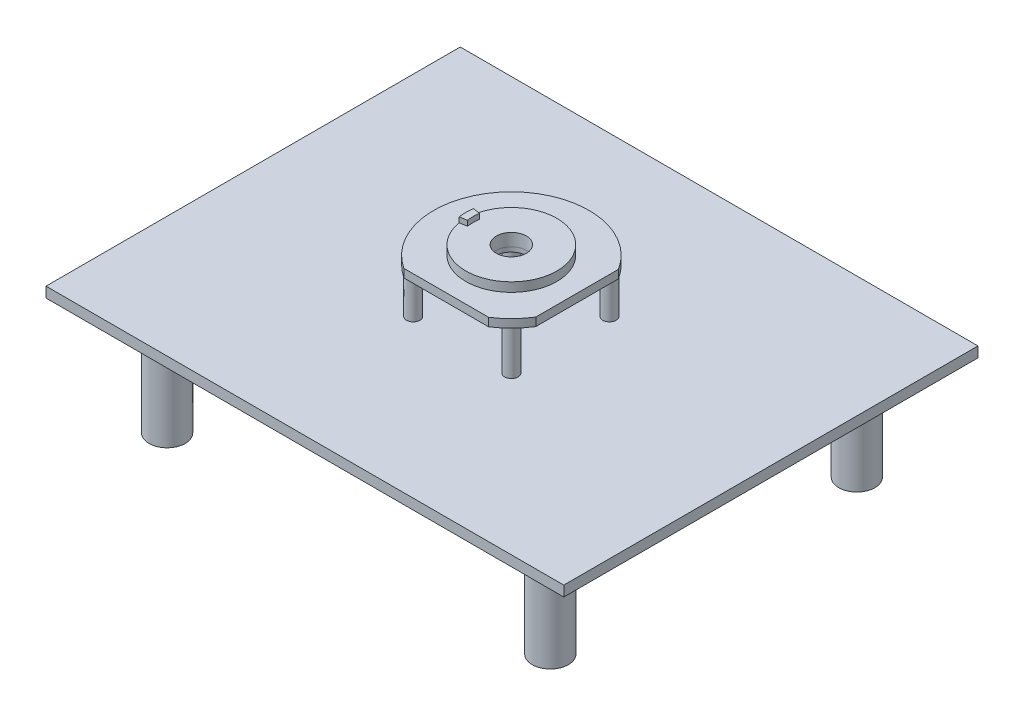
ISO-10303-21;
HEADER;
FILE_DESCRIPTION(('STEP AP214'),'2;1');
FILE_NAME('part.step','',(''),(''),'','','');
FILE_SCHEMA(('AUTOMOTIVE_DESIGN { 1 0 10303 214 1 1 1 1 }'));
ENDSEC;
DATA;
#1=APPLICATION_CONTEXT('core data for automotive mechanical design processes');
#2=APPLICATION_PROTOCOL_DEFINITION('international standard','automotive_design',2000,#1);
#3=PRODUCT_CONTEXT('',#1,'mechanical');
#4=PRODUCT('Part','Part','',(#3));
#5=PRODUCT_RELATED_PRODUCT_CATEGORY('part','',(#4));
#6=PRODUCT_DEFINITION_FORMATION('','',#4);
#7=PRODUCT_DEFINITION_CONTEXT('part definition',#1,'design');
#8=PRODUCT_DEFINITION('design','',#6,#7);
#9=PRODUCT_DEFINITION_SHAPE('','',#8);
#10=(LENGTH_UNIT() NAMED_UNIT(*) SI_UNIT(.MILLI.,.METRE.));
#11=(NAMED_UNIT(*) PLANE_ANGLE_UNIT() SI_UNIT($,.RADIAN.));
#12=(NAMED_UNIT(*) SI_UNIT($,.STERADIAN.) SOLID_ANGLE_UNIT());
#13=UNCERTAINTY_MEASURE_WITH_UNIT(LENGTH_MEASURE(1.E-05),#10,'distance_accuracy_value','');
#14=(GEOMETRIC_REPRESENTATION_CONTEXT(3) GLOBAL_UNCERTAINTY_ASSIGNED_CONTEXT((#13)) GLOBAL_UNIT_ASSIGNED_CONTEXT((#10,
#11,#12)) REPRESENTATION_CONTEXT('',''));
#15=CARTESIAN_POINT('',(0.,0.,0.));
#16=DIRECTION('',(0.,0.,1.));
#17=DIRECTION('',(1.,0.,0.));
#18=AXIS2_PLACEMENT_3D('',#15,#16,#17);
#19=CARTESIAN_POINT('',(0.,50.,0.623845660501408));
#20=DIRECTION('',(0.,1.,0.));
#21=DIRECTION('',(-1.,0.,0.));
#22=AXIS2_PLACEMENT_3D('',#19,#20,#21);
#23=CYLINDRICAL_SURFACE('',#22,75.);
#24=CARTESIAN_POINT('',(0.,53.175,0.623845660501408));
#25=DIRECTION('',(0.,-1.,0.));
#26=DIRECTION('',(1.,0.,0.));
#27=AXIS2_PLACEMENT_3D('',#24,#25,#26);
#28=CIRCLE('',#27,75.);
#29=CARTESIAN_POINT('',(63.5,53.175,40.5331177661161));
#30=VERTEX_POINT('',#29);
#31=CARTESIAN_POINT('',(40.8850732599998,53.175,63.5));
#32=VERTEX_POINT('',#31);
#33=EDGE_CURVE('E239',#30,#32,#28,.T.);
#34=ORIENTED_EDGE('',*,*,#33,.F.);
#35=DIRECTION('',(0.,1.,0.));
#36=VECTOR('',#35,1.);
#37=CARTESIAN_POINT('',(63.5,50.,40.5331177661161));
#38=LINE('',#37,#36);
#39=CARTESIAN_POINT('',(63.5,61.175,40.5331177661161));
#40=VERTEX_POINT('',#39);
#41=EDGE_CURVE('E62',#30,#40,#38,.T.);
#42=ORIENTED_EDGE('',*,*,#41,.T.);
#43=CARTESIAN_POINT('',(0.,61.175,0.623845660501408));
#44=DIRECTION('',(0.,-1.,0.));
#45=DIRECTION('',(1.,0.,0.));
#46=AXIS2_PLACEMENT_3D('',#43,#44,#45);
#47=CIRCLE('',#46,75.);
#48=CARTESIAN_POINT('',(40.8850732599998,61.175,63.5));
#49=VERTEX_POINT('',#48);
#50=EDGE_CURVE('E238',#40,#49,#47,.T.);
#51=ORIENTED_EDGE('',*,*,#50,.T.);
#52=DIRECTION('',(0.,1.,0.));
#53=VECTOR('',#52,1.);
#54=CARTESIAN_POINT('',(40.8850732599998,50.,63.5));
#55=LINE('',#54,#53);
#56=EDGE_CURVE('E266',#49,#32,#55,.F.);
#57=ORIENTED_EDGE('',*,*,#56,.T.);
#58=EDGE_LOOP('',(#34,#42,#51,#57));
#59=FACE_BOUND('',#58,.T.);
#60=ADVANCED_FACE('F44',(#59),#23,.T.);
#61=CARTESIAN_POINT('',(14.5,58.,0.623845660501408));
#62=DIRECTION('',(0.,-1.,0.));
#63=DIRECTION('',(0.,0.,-1.));
#64=AXIS2_PLACEMENT_3D('',#61,#62,#63);
#65=PLANE('',#64);
#66=CARTESIAN_POINT('',(0.,58.,0.623845660501408));
#67=DIRECTION('',(0.,-1.,0.));
#68=DIRECTION('',(0.,0.,-1.));
#69=AXIS2_PLACEMENT_3D('',#66,#67,#68);
#70=CIRCLE('',#69,14.5);
#71=CARTESIAN_POINT('',(0.,58.,-13.8761543394986));
#72=VERTEX_POINT('',#71);
#73=EDGE_CURVE('E274',#72,#72,#70,.T.);
#74=ORIENTED_EDGE('',*,*,#73,.F.);
#75=EDGE_LOOP('',(#74));
#76=FACE_BOUND('',#75,.T.);
#77=CARTESIAN_POINT('',(0.,58.,0.623845660501408));
#78=DIRECTION('',(0.,1.,0.));
#79=DIRECTION('',(-1.,0.,0.));
#80=AXIS2_PLACEMENT_3D('',#77,#78,#79);
#81=CIRCLE('',#80,15.);
#82=CARTESIAN_POINT('',(-15.,58.,0.623845660501408));
#83=VERTEX_POINT('',#82);
#84=EDGE_CURVE('E242',#83,#83,#81,.T.);
#85=ORIENTED_EDGE('',*,*,#84,.F.);
#86=EDGE_LOOP('',(#85));
#87=FACE_BOUND('',#86,.T.);
#88=ADVANCED_FACE('F302',(#76,#87),#65,.T.);
#89=CARTESIAN_POINT('',(0.,58.,0.623845660501408));
#90=DIRECTION('',(0.,-1.,0.));
#91=DIRECTION('',(0.,0.,-1.));
#92=AXIS2_PLACEMENT_3D('',#89,#90,#91);
#93=CYLINDRICAL_SURFACE('',#92,44.);
#94=CARTESIAN_POINT('',(0.,70.,0.623845660501408));
#95=DIRECTION('',(0.,-1.,0.));
#96=DIRECTION('',(0.,0.,-1.));
#97=AXIS2_PLACEMENT_3D('',#94,#95,#96);
#98=CIRCLE('',#97,44.);
#99=CARTESIAN_POINT('',(-43.458286986186,70.,-6.25927080126876));
#100=VERTEX_POINT('',#99);
#101=CARTESIAN_POINT('',(-43.458286986186,70.,7.50696212227159));
#102=VERTEX_POINT('',#101);
#103=EDGE_CURVE('E218',#100,#102,#98,.T.);
#104=ORIENTED_EDGE('',*,*,#103,.T.);
#105=DIRECTION('',(0.,-1.,0.));
#106=VECTOR('',#105,1.);
#107=CARTESIAN_POINT('',(-43.458286986186,75.,7.50696212227159));
#108=LINE('',#107,#106);
#109=CARTESIAN_POINT('',(-43.458286986186,75.,7.50696212227159));
#110=VERTEX_POINT('',#109);
#111=EDGE_CURVE('E220',#110,#102,#108,.T.);
#112=ORIENTED_EDGE('',*,*,#111,.F.);
#113=CARTESIAN_POINT('',(0.,75.,0.623845660501408));
#114=DIRECTION('',(0.,1.,0.));
#115=DIRECTION('',(0.,0.,1.));
#116=AXIS2_PLACEMENT_3D('',#113,#114,#115);
#117=CIRCLE('',#116,44.);
#118=CARTESIAN_POINT('',(-43.458286986186,75.,-6.25927080126876));
#119=VERTEX_POINT('',#118);
#120=EDGE_CURVE('E198',#119,#110,#117,.T.);
#121=ORIENTED_EDGE('',*,*,#120,.F.);
#122=DIRECTION('',(0.,-1.,0.));
#123=VECTOR('',#122,1.);
#124=CARTESIAN_POINT('',(-43.458286986186,75.,-6.25927080126876));
#125=LINE('',#124,#123);
#126=EDGE_CURVE('E209',#119,#100,#125,.T.);
#127=ORIENTED_EDGE('',*,*,#126,.T.);
#128=EDGE_LOOP('',(#104,#112,#121,#127));
#129=FACE_BOUND('',#128,.T.);
#130=CARTESIAN_POINT('',(0.,61.175,0.623845660501408));
#131=DIRECTION('',(0.,-1.,0.));
#132=DIRECTION('',(0.,0.,-1.));
#133=AXIS2_PLACEMENT_3D('',#130,#131,#132);
#134=CIRCLE('',#133,44.);
#135=CARTESIAN_POINT('',(0.,61.175,-43.3761543394986));
#136=VERTEX_POINT('',#135);
#137=EDGE_CURVE('E271',#136,#136,#134,.T.);
#138=ORIENTED_EDGE('',*,*,#137,.F.);
#139=EDGE_LOOP('',(#138));
#140=FACE_BOUND('',#139,.T.);
#141=ADVANCED_FACE('F311',(#129,#140),#93,.T.);
#142=CARTESIAN_POINT('',(0.,58.,0.623845660501408));
#143=DIRECTION('',(0.,-1.,0.));
#144=DIRECTION('',(0.,0.,-1.));
#145=AXIS2_PLACEMENT_3D('',#142,#143,#144);
#146=CYLINDRICAL_SURFACE('',#145,14.5);
#147=ORIENTED_EDGE('',*,*,#73,.T.);
#148=EDGE_LOOP('',(#147));
#149=FACE_BOUND('',#148,.T.);
#150=CARTESIAN_POINT('',(0.,70.,0.623845660501408));
#151=DIRECTION('',(0.,-1.,0.));
#152=DIRECTION('',(0.,0.,-1.));
#153=AXIS2_PLACEMENT_3D('',#150,#151,#152);
#154=CIRCLE('',#153,14.5);
#155=CARTESIAN_POINT('',(0.,70.,-13.8761543394986));
#156=VERTEX_POINT('',#155);
#157=EDGE_CURVE('E616',#156,#156,#154,.T.);
#158=ORIENTED_EDGE('',*,*,#157,.F.);
#159=EDGE_LOOP('',(#158));
#160=FACE_BOUND('',#159,.T.);
#161=ADVANCED_FACE('F422',(#149,#160),#146,.F.);
#162=CARTESIAN_POINT('',(14.5,70.,0.623845660501408));
#163=DIRECTION('',(0.,1.,0.));
#164=DIRECTION('',(0.,0.,1.));
#165=AXIS2_PLACEMENT_3D('',#162,#163,#164);
#166=PLANE('',#165);
#167=DIRECTION('',(-0.987688340595138,0.,-0.156434465040231));
#168=VECTOR('',#167,1.);
#169=CARTESIAN_POINT('',(0.,70.,0.623845660501408));
#170=LINE('',#169,#168);
#171=CARTESIAN_POINT('',(-36.5444686020201,70.,-5.16422954598714));
#172=VERTEX_POINT('',#171);
#173=EDGE_CURVE('E201',#172,#100,#170,.T.);
#174=ORIENTED_EDGE('',*,*,#173,.F.);
#175=CARTESIAN_POINT('',(0.,70.,0.623845660501408));
#176=DIRECTION('',(0.,1.,0.));
#177=DIRECTION('',(0.,0.,1.));
#178=AXIS2_PLACEMENT_3D('',#175,#176,#177);
#179=CIRCLE('',#178,37.);
#180=CARTESIAN_POINT('',(-36.5444686020201,70.,6.41192086698997));
#181=VERTEX_POINT('',#180);
#182=EDGE_CURVE('E212',#172,#181,#179,.T.);
#183=ORIENTED_EDGE('',*,*,#182,.T.);
#184=DIRECTION('',(-0.987688340595138,0.,0.156434465040232));
#185=VECTOR('',#184,1.);
#186=CARTESIAN_POINT('',(0.,70.,0.623845660501408));
#187=LINE('',#186,#185);
#188=EDGE_CURVE('E197',#181,#102,#187,.T.);
#189=ORIENTED_EDGE('',*,*,#188,.T.);
#190=ORIENTED_EDGE('',*,*,#103,.F.);
#191=EDGE_LOOP('',(#174,#183,#189,#190));
#192=FACE_BOUND('',#191,.T.);
#193=ORIENTED_EDGE('',*,*,#157,.T.);
#194=EDGE_LOOP('',(#193));
#195=FACE_BOUND('',#194,.T.);
#196=ADVANCED_FACE('F418',(#192,#195),#166,.T.);
#197=CARTESIAN_POINT('',(0.,75.,0.623845660501408));
#198=DIRECTION('',(0.156434465040232,0.,0.987688340595138));
#199=DIRECTION('',(0.987688340595138,0.,-0.156434465040232));
#200=AXIS2_PLACEMENT_3D('',#197,#198,#199);
#201=PLANE('',#200);
#202=ORIENTED_EDGE('',*,*,#188,.F.);
#203=DIRECTION('',(0.,-1.,0.));
#204=VECTOR('',#203,1.);
#205=CARTESIAN_POINT('',(-36.5444686020201,75.,6.41192086698997));
#206=LINE('',#205,#204);
#207=CARTESIAN_POINT('',(-36.5444686020201,75.,6.41192086698997));
#208=VERTEX_POINT('',#207);
#209=EDGE_CURVE('E222',#208,#181,#206,.T.);
#210=ORIENTED_EDGE('',*,*,#209,.F.);
#211=DIRECTION('',(-0.987688340595138,0.,0.156434465040232));
#212=VECTOR('',#211,1.);
#213=CARTESIAN_POINT('',(0.,75.,0.623845660501408));
#214=LINE('',#213,#212);
#215=EDGE_CURVE('E200',#208,#110,#214,.T.);
#216=ORIENTED_EDGE('',*,*,#215,.T.);
#217=ORIENTED_EDGE('',*,*,#111,.T.);
#218=EDGE_LOOP('',(#202,#210,#216,#217));
#219=FACE_BOUND('',#218,.T.);
#220=ADVANCED_FACE('F414',(#219),#201,.T.);
#221=CARTESIAN_POINT('',(0.,75.,0.623845660501408));
#222=DIRECTION('',(0.,-1.,0.));
#223=DIRECTION('',(0.,0.,-1.));
#224=AXIS2_PLACEMENT_3D('',#221,#222,#223);
#225=CYLINDRICAL_SURFACE('',#224,37.);
#226=ORIENTED_EDGE('',*,*,#182,.F.);
#227=DIRECTION('',(0.,-1.,0.));
#228=VECTOR('',#227,1.);
#229=CARTESIAN_POINT('',(-36.5444686020201,75.,-5.16422954598714));
#230=LINE('',#229,#228);
#231=CARTESIAN_POINT('',(-36.5444686020201,75.,-5.16422954598714));
#232=VERTEX_POINT('',#231);
#233=EDGE_CURVE('E230',#232,#172,#230,.T.);
#234=ORIENTED_EDGE('',*,*,#233,.F.);
#235=CARTESIAN_POINT('',(0.,75.,0.623845660501408));
#236=DIRECTION('',(0.,1.,0.));
#237=DIRECTION('',(0.,0.,1.));
#238=AXIS2_PLACEMENT_3D('',#235,#236,#237);
#239=CIRCLE('',#238,37.);
#240=EDGE_CURVE('E204',#232,#208,#239,.T.);
#241=ORIENTED_EDGE('',*,*,#240,.T.);
#242=ORIENTED_EDGE('',*,*,#209,.T.);
#243=EDGE_LOOP('',(#226,#234,#241,#242));
#244=FACE_BOUND('',#243,.T.);
#245=ADVANCED_FACE('F410',(#244),#225,.F.);
#246=CARTESIAN_POINT('',(0.,75.,0.623845660501408));
#247=DIRECTION('',(-0.156434465040231,0.,0.987688340595138));
#248=DIRECTION('',(0.987688340595138,0.,0.156434465040231));
#249=AXIS2_PLACEMENT_3D('',#246,#247,#248);
#250=PLANE('',#249);
#251=ORIENTED_EDGE('',*,*,#173,.T.);
#252=ORIENTED_EDGE('',*,*,#126,.F.);
#253=DIRECTION('',(-0.987688340595138,0.,-0.156434465040231));
#254=VECTOR('',#253,1.);
#255=CARTESIAN_POINT('',(0.,75.,0.623845660501408));
#256=LINE('',#255,#254);
#257=EDGE_CURVE('E207',#232,#119,#256,.T.);
#258=ORIENTED_EDGE('',*,*,#257,.F.);
#259=ORIENTED_EDGE('',*,*,#233,.T.);
#260=EDGE_LOOP('',(#251,#252,#258,#259));
#261=FACE_BOUND('',#260,.T.);
#262=ADVANCED_FACE('F406',(#261),#250,.F.);
#263=CARTESIAN_POINT('',(0.,75.,0.623845660501408));
#264=DIRECTION('',(0.,1.,0.));
#265=DIRECTION('',(0.,0.,1.));
#266=AXIS2_PLACEMENT_3D('',#263,#264,#265);
#267=PLANE('',#266);
#268=ORIENTED_EDGE('',*,*,#120,.T.);
#269=ORIENTED_EDGE('',*,*,#215,.F.);
#270=ORIENTED_EDGE('',*,*,#240,.F.);
#271=ORIENTED_EDGE('',*,*,#257,.T.);
#272=EDGE_LOOP('',(#268,#269,#270,#271));
#273=FACE_BOUND('',#272,.T.);
#274=ADVANCED_FACE('F403',(#273),#267,.T.);
#275=CARTESIAN_POINT('',(0.,61.175,0.623845660501408));
#276=DIRECTION('',(0.,-1.,0.));
#277=DIRECTION('',(1.,0.,0.));
#278=AXIS2_PLACEMENT_3D('',#275,#276,#277);
#279=PLANE('',#278);
#280=ORIENTED_EDGE('',*,*,#50,.F.);
#281=DIRECTION('',(0.,0.,1.));
#282=VECTOR('',#281,1.);
#283=CARTESIAN_POINT('',(63.5,61.175,-50.8));
#284=LINE('',#283,#282);
#285=CARTESIAN_POINT('',(63.5,61.175,-39.2854264451133));
#286=VERTEX_POINT('',#285);
#287=EDGE_CURVE('E269',#286,#40,#284,.T.);
#288=ORIENTED_EDGE('',*,*,#287,.F.);
#289=CARTESIAN_POINT('',(0.,61.175,0.623845660501408));
#290=DIRECTION('',(0.,-1.,0.));
#291=DIRECTION('',(1.,0.,0.));
#292=AXIS2_PLACEMENT_3D('',#289,#290,#291);
#293=CIRCLE('',#292,75.);
#294=CARTESIAN_POINT('',(-40.8850732599998,61.175,63.5));
#295=VERTEX_POINT('',#294);
#296=EDGE_CURVE('E257',#295,#286,#293,.T.);
#297=ORIENTED_EDGE('',*,*,#296,.F.);
#298=DIRECTION('',(-1.,0.,0.));
#299=VECTOR('',#298,1.);
#300=CARTESIAN_POINT('',(-50.8,61.175,63.5));
#301=LINE('',#300,#299);
#302=EDGE_CURVE('E264',#49,#295,#301,.T.);
#303=ORIENTED_EDGE('',*,*,#302,.F.);
#304=EDGE_LOOP('',(#280,#288,#297,#303));
#305=FACE_BOUND('',#304,.T.);
#306=ORIENTED_EDGE('',*,*,#137,.T.);
#307=EDGE_LOOP('',(#306));
#308=FACE_BOUND('',#307,.T.);
#309=ADVANCED_FACE('F338',(#305,#308),#279,.F.);
#310=CARTESIAN_POINT('',(0.,0.,0.));
#311=DIRECTION('',(0.,-1.,0.));
#312=DIRECTION('',(0.,0.,-1.));
#313=AXIS2_PLACEMENT_3D('',#310,#311,#312);
#314=PLANE('',#313);
#315=CARTESIAN_POINT('',(0.,0.,0.6238494));
#316=DIRECTION('',(0.,-1.,0.));
#317=DIRECTION('',(0.,0.,-1.));
#318=AXIS2_PLACEMENT_3D('',#315,#316,#317);
#319=CIRCLE('',#318,10.);
#320=CARTESIAN_POINT('',(0.,0.,-9.3761506));
#321=VERTEX_POINT('',#320);
#322=EDGE_CURVE('E159',#321,#321,#319,.T.);
#323=ORIENTED_EDGE('',*,*,#322,.F.);
#324=EDGE_LOOP('',(#323));
#325=FACE_BOUND('',#324,.T.);
#326=CARTESIAN_POINT('',(-185.,0.,148.));
#327=DIRECTION('',(0.,-1.,0.));
#328=DIRECTION('',(0.,0.,-1.));
#329=AXIS2_PLACEMENT_3D('',#326,#327,#328);
#330=CIRCLE('',#329,17.5);
#331=CARTESIAN_POINT('',(-185.,0.,130.5));
#332=VERTEX_POINT('',#331);
#333=EDGE_CURVE('E194',#332,#332,#330,.T.);
#334=ORIENTED_EDGE('',*,*,#333,.F.);
#335=EDGE_LOOP('',(#334));
#336=FACE_BOUND('',#335,.T.);
#337=CARTESIAN_POINT('',(-185.,0.,-148.));
#338=DIRECTION('',(0.,-1.,0.));
#339=DIRECTION('',(0.,0.,-1.));
#340=AXIS2_PLACEMENT_3D('',#337,#338,#339);
#341=CIRCLE('',#340,17.5);
#342=CARTESIAN_POINT('',(-185.,0.,-165.5));
#343=VERTEX_POINT('',#342);
#344=EDGE_CURVE('E175',#343,#343,#341,.T.);
#345=ORIENTED_EDGE('',*,*,#344,.F.);
#346=EDGE_LOOP('',(#345));
#347=FACE_BOUND('',#346,.T.);
#348=DIRECTION('',(0.,0.,1.));
#349=VECTOR('',#348,1.);
#350=CARTESIAN_POINT('',(-250.,0.,-200.));
#351=LINE('',#350,#349);
#352=CARTESIAN_POINT('',(-250.,0.,-200.));
#353=VERTEX_POINT('',#352);
#354=CARTESIAN_POINT('',(-250.,0.,200.));
#355=VERTEX_POINT('',#354);
#356=EDGE_CURVE('E179',#353,#355,#351,.T.);
#357=ORIENTED_EDGE('',*,*,#356,.F.);
#358=DIRECTION('',(-1.,0.,0.));
#359=VECTOR('',#358,1.);
#360=CARTESIAN_POINT('',(250.,0.,-200.));
#361=LINE('',#360,#359);
#362=CARTESIAN_POINT('',(250.,0.,-200.));
#363=VERTEX_POINT('',#362);
#364=EDGE_CURVE('E139',#363,#353,#361,.T.);
#365=ORIENTED_EDGE('',*,*,#364,.F.);
#366=DIRECTION('',(0.,0.,-1.));
#367=VECTOR('',#366,1.);
#368=CARTESIAN_POINT('',(250.,0.,-200.));
#369=LINE('',#368,#367);
#370=CARTESIAN_POINT('',(250.,0.,200.));
#371=VERTEX_POINT('',#370);
#372=EDGE_CURVE('E183',#371,#363,#369,.T.);
#373=ORIENTED_EDGE('',*,*,#372,.F.);
#374=DIRECTION('',(1.,0.,0.));
#375=VECTOR('',#374,1.);
#376=CARTESIAN_POINT('',(250.,0.,200.));
#377=LINE('',#376,#375);
#378=EDGE_CURVE('E181',#355,#371,#377,.T.);
#379=ORIENTED_EDGE('',*,*,#378,.F.);
#380=EDGE_LOOP('',(#357,#365,#373,#379));
#381=FACE_BOUND('',#380,.T.);
#382=CARTESIAN_POINT('',(185.,0.,-148.));
#383=DIRECTION('',(0.,-1.,0.));
#384=DIRECTION('',(0.,0.,-1.));
#385=AXIS2_PLACEMENT_3D('',#382,#383,#384);
#386=CIRCLE('',#385,17.5);
#387=CARTESIAN_POINT('',(185.,0.,-165.5));
#388=VERTEX_POINT('',#387);
#389=EDGE_CURVE('E191',#388,#388,#386,.T.);
#390=ORIENTED_EDGE('',*,*,#389,.F.);
#391=EDGE_LOOP('',(#390));
#392=FACE_BOUND('',#391,.T.);
#393=CARTESIAN_POINT('',(185.,0.,148.));
#394=DIRECTION('',(0.,-1.,0.));
#395=DIRECTION('',(0.,0.,1.));
#396=AXIS2_PLACEMENT_3D('',#393,#394,#395);
#397=CIRCLE('',#396,17.5);
#398=CARTESIAN_POINT('',(185.,0.,165.5));
#399=VERTEX_POINT('',#398);
#400=EDGE_CURVE('E171',#399,#399,#397,.T.);
#401=ORIENTED_EDGE('',*,*,#400,.F.);
#402=EDGE_LOOP('',(#401));
#403=FACE_BOUND('',#402,.T.);
#404=ADVANCED_FACE('F387',(#325,#336,#347,#381,#392,#403),#314,.T.);
#405=CARTESIAN_POINT('',(-250.,4.,-200.));
#406=DIRECTION('',(1.,0.,0.));
#407=DIRECTION('',(0.,0.,-1.));
#408=AXIS2_PLACEMENT_3D('',#405,#406,#407);
#409=PLANE('',#408);
#410=ORIENTED_EDGE('',*,*,#356,.T.);
#411=DIRECTION('',(0.,-1.,0.));
#412=VECTOR('',#411,1.);
#413=CARTESIAN_POINT('',(-250.,4.,200.));
#414=LINE('',#413,#412);
#415=CARTESIAN_POINT('',(-250.,10.,200.));
#416=VERTEX_POINT('',#415);
#417=EDGE_CURVE('E149',#416,#355,#414,.T.);
#418=ORIENTED_EDGE('',*,*,#417,.F.);
#419=DIRECTION('',(0.,0.,1.));
#420=VECTOR('',#419,1.);
#421=CARTESIAN_POINT('',(-250.,10.,-200.));
#422=LINE('',#421,#420);
#423=CARTESIAN_POINT('',(-250.,10.,-200.));
#424=VERTEX_POINT('',#423);
#425=EDGE_CURVE('E146',#424,#416,#422,.T.);
#426=ORIENTED_EDGE('',*,*,#425,.F.);
#427=DIRECTION('',(0.,-1.,0.));
#428=VECTOR('',#427,1.);
#429=CARTESIAN_POINT('',(-250.,4.,-200.));
#430=LINE('',#429,#428);
#431=EDGE_CURVE('E132',#424,#353,#430,.T.);
#432=ORIENTED_EDGE('',*,*,#431,.T.);
#433=EDGE_LOOP('',(#410,#418,#426,#432));
#434=FACE_BOUND('',#433,.T.);
#435=ADVANCED_FACE('F147',(#434),#409,.F.);
#436=CARTESIAN_POINT('',(250.,4.,200.));
#437=DIRECTION('',(0.,0.,-1.));
#438=DIRECTION('',(-1.,0.,0.));
#439=AXIS2_PLACEMENT_3D('',#436,#437,#438);
#440=PLANE('',#439);
#441=ORIENTED_EDGE('',*,*,#378,.T.);
#442=DIRECTION('',(0.,-1.,0.));
#443=VECTOR('',#442,1.);
#444=CARTESIAN_POINT('',(250.,4.,200.));
#445=LINE('',#444,#443);
#446=CARTESIAN_POINT('',(250.,10.,200.));
#447=VERTEX_POINT('',#446);
#448=EDGE_CURVE('E187',#447,#371,#445,.T.);
#449=ORIENTED_EDGE('',*,*,#448,.F.);
#450=DIRECTION('',(1.,0.,0.));
#451=VECTOR('',#450,1.);
#452=CARTESIAN_POINT('',(-250.,10.,200.));
#453=LINE('',#452,#451);
#454=EDGE_CURVE('E153',#416,#447,#453,.T.);
#455=ORIENTED_EDGE('',*,*,#454,.F.);
#456=ORIENTED_EDGE('',*,*,#417,.T.);
#457=EDGE_LOOP('',(#441,#449,#455,#456));
#458=FACE_BOUND('',#457,.T.);
#459=ADVANCED_FACE('F396',(#458),#440,.F.);
#460=CARTESIAN_POINT('',(250.,4.,-200.));
#461=DIRECTION('',(-1.,0.,0.));
#462=DIRECTION('',(0.,0.,1.));
#463=AXIS2_PLACEMENT_3D('',#460,#461,#462);
#464=PLANE('',#463);
#465=ORIENTED_EDGE('',*,*,#372,.T.);
#466=DIRECTION('',(0.,-1.,0.));
#467=VECTOR('',#466,1.);
#468=CARTESIAN_POINT('',(250.,4.,-200.));
#469=LINE('',#468,#467);
#470=CARTESIAN_POINT('',(250.,10.,-200.));
#471=VERTEX_POINT('',#470);
#472=EDGE_CURVE('E143',#471,#363,#469,.T.);
#473=ORIENTED_EDGE('',*,*,#472,.F.);
#474=DIRECTION('',(0.,0.,-1.));
#475=VECTOR('',#474,1.);
#476=CARTESIAN_POINT('',(250.,10.,200.));
#477=LINE('',#476,#475);
#478=EDGE_CURVE('E158',#447,#471,#477,.T.);
#479=ORIENTED_EDGE('',*,*,#478,.F.);
#480=ORIENTED_EDGE('',*,*,#448,.T.);
#481=EDGE_LOOP('',(#465,#473,#479,#480));
#482=FACE_BOUND('',#481,.T.);
#483=ADVANCED_FACE('F393',(#482),#464,.F.);
#484=CARTESIAN_POINT('',(250.,4.,-200.));
#485=DIRECTION('',(0.,0.,1.));
#486=DIRECTION('',(1.,0.,0.));
#487=AXIS2_PLACEMENT_3D('',#484,#485,#486);
#488=PLANE('',#487);
#489=ORIENTED_EDGE('',*,*,#364,.T.);
#490=ORIENTED_EDGE('',*,*,#431,.F.);
#491=DIRECTION('',(-1.,0.,0.));
#492=VECTOR('',#491,1.);
#493=CARTESIAN_POINT('',(250.,10.,-200.));
#494=LINE('',#493,#492);
#495=EDGE_CURVE('E137',#471,#424,#494,.T.);
#496=ORIENTED_EDGE('',*,*,#495,.F.);
#497=ORIENTED_EDGE('',*,*,#472,.T.);
#498=EDGE_LOOP('',(#489,#490,#496,#497));
#499=FACE_BOUND('',#498,.T.);
#500=ADVANCED_FACE('F134',(#499),#488,.F.);
#501=CARTESIAN_POINT('',(-185.,-100.,-148.));
#502=DIRECTION('',(0.,1.,0.));
#503=DIRECTION('',(0.,0.,1.));
#504=AXIS2_PLACEMENT_3D('',#501,#502,#503);
#505=CYLINDRICAL_SURFACE('',#504,17.5);
#506=CARTESIAN_POINT('',(-185.,-106.35,-148.));
#507=DIRECTION('',(0.,-1.,0.));
#508=DIRECTION('',(0.,0.,-1.));
#509=AXIS2_PLACEMENT_3D('',#506,#507,#508);
#510=CIRCLE('',#509,17.5);
#511=CARTESIAN_POINT('',(-185.,-106.35,-165.5));
#512=VERTEX_POINT('',#511);
#513=EDGE_CURVE('E178',#512,#512,#510,.T.);
#514=ORIENTED_EDGE('',*,*,#513,.F.);
#515=EDGE_LOOP('',(#514));
#516=FACE_BOUND('',#515,.T.);
#517=ORIENTED_EDGE('',*,*,#344,.T.);
#518=EDGE_LOOP('',(#517));
#519=FACE_BOUND('',#518,.T.);
#520=ADVANCED_FACE('F383',(#516,#519),#505,.T.);
#521=CARTESIAN_POINT('',(-185.,-106.35,-148.));
#522=DIRECTION('',(0.,-1.,0.));
#523=DIRECTION('',(0.,0.,-1.));
#524=AXIS2_PLACEMENT_3D('',#521,#522,#523);
#525=PLANE('',#524);
#526=ORIENTED_EDGE('',*,*,#513,.T.);
#527=EDGE_LOOP('',(#526));
#528=FACE_BOUND('',#527,.T.);
#529=ADVANCED_FACE('F298',(#528),#525,.T.);
#530=CARTESIAN_POINT('',(185.,-100.,-148.));
#531=DIRECTION('',(0.,1.,0.));
#532=DIRECTION('',(0.,0.,1.));
#533=AXIS2_PLACEMENT_3D('',#530,#531,#532);
#534=CYLINDRICAL_SURFACE('',#533,17.5);
#535=CARTESIAN_POINT('',(185.,-106.35,-148.));
#536=DIRECTION('',(0.,-1.,0.));
#537=DIRECTION('',(0.,0.,-1.));
#538=AXIS2_PLACEMENT_3D('',#535,#536,#537);
#539=CIRCLE('',#538,17.5);
#540=CARTESIAN_POINT('',(185.,-106.35,-165.5));
#541=VERTEX_POINT('',#540);
#542=EDGE_CURVE('E48',#541,#541,#539,.F.);
#543=ORIENTED_EDGE('',*,*,#542,.T.);
#544=EDGE_LOOP('',(#543));
#545=FACE_BOUND('',#544,.T.);
#546=ORIENTED_EDGE('',*,*,#389,.T.);
#547=EDGE_LOOP('',(#546));
#548=FACE_BOUND('',#547,.T.);
#549=ADVANCED_FACE('F284',(#545,#548),#534,.T.);
#550=CARTESIAN_POINT('',(185.,-106.35,-148.));
#551=DIRECTION('',(0.,-1.,0.));
#552=DIRECTION('',(0.,0.,-1.));
#553=AXIS2_PLACEMENT_3D('',#550,#551,#552);
#554=PLANE('',#553);
#555=ORIENTED_EDGE('',*,*,#542,.F.);
#556=EDGE_LOOP('',(#555));
#557=FACE_BOUND('',#556,.T.);
#558=ADVANCED_FACE('F287',(#557),#554,.T.);
#559=CARTESIAN_POINT('',(185.,-100.,148.));
#560=DIRECTION('',(0.,1.,0.));
#561=DIRECTION('',(0.,0.,1.));
#562=AXIS2_PLACEMENT_3D('',#559,#560,#561);
#563=CYLINDRICAL_SURFACE('',#562,17.5);
#564=CARTESIAN_POINT('',(185.,-106.35,148.));
#565=DIRECTION('',(0.,-1.,0.));
#566=DIRECTION('',(0.,0.,-1.));
#567=AXIS2_PLACEMENT_3D('',#564,#565,#566);
#568=CIRCLE('',#567,17.5);
#569=CARTESIAN_POINT('',(185.,-106.35,130.5));
#570=VERTEX_POINT('',#569);
#571=EDGE_CURVE('E174',#570,#570,#568,.T.);
#572=ORIENTED_EDGE('',*,*,#571,.F.);
#573=EDGE_LOOP('',(#572));
#574=FACE_BOUND('',#573,.T.);
#575=ORIENTED_EDGE('',*,*,#400,.T.);
#576=EDGE_LOOP('',(#575));
#577=FACE_BOUND('',#576,.T.);
#578=ADVANCED_FACE('F289',(#574,#577),#563,.T.);
#579=CARTESIAN_POINT('',(185.,-106.35,148.));
#580=DIRECTION('',(0.,-1.,0.));
#581=DIRECTION('',(0.,0.,1.));
#582=AXIS2_PLACEMENT_3D('',#579,#580,#581);
#583=PLANE('',#582);
#584=ORIENTED_EDGE('',*,*,#571,.T.);
#585=EDGE_LOOP('',(#584));
#586=FACE_BOUND('',#585,.T.);
#587=ADVANCED_FACE('F295',(#586),#583,.T.);
#588=CARTESIAN_POINT('',(-185.,-100.,148.));
#589=DIRECTION('',(0.,1.,0.));
#590=DIRECTION('',(0.,0.,1.));
#591=AXIS2_PLACEMENT_3D('',#588,#589,#590);
#592=CYLINDRICAL_SURFACE('',#591,17.5);
#593=CARTESIAN_POINT('',(-185.,-106.35,148.));
#594=DIRECTION('',(0.,-1.,0.));
#595=DIRECTION('',(0.,0.,-1.));
#596=AXIS2_PLACEMENT_3D('',#593,#594,#595);
#597=CIRCLE('',#596,17.5);
#598=CARTESIAN_POINT('',(-185.,-106.35,130.5));
#599=VERTEX_POINT('',#598);
#600=EDGE_CURVE('E170',#599,#599,#597,.F.);
#601=ORIENTED_EDGE('',*,*,#600,.T.);
#602=EDGE_LOOP('',(#601));
#603=FACE_BOUND('',#602,.T.);
#604=ORIENTED_EDGE('',*,*,#333,.T.);
#605=EDGE_LOOP('',(#604));
#606=FACE_BOUND('',#605,.T.);
#607=ADVANCED_FACE('F379',(#603,#606),#592,.T.);
#608=CARTESIAN_POINT('',(-185.,-106.35,148.));
#609=DIRECTION('',(0.,-1.,0.));
#610=DIRECTION('',(0.,0.,1.));
#611=AXIS2_PLACEMENT_3D('',#608,#609,#610);
#612=PLANE('',#611);
#613=ORIENTED_EDGE('',*,*,#600,.F.);
#614=EDGE_LOOP('',(#613));
#615=FACE_BOUND('',#614,.T.);
#616=ADVANCED_FACE('F46',(#615),#612,.T.);
#617=CARTESIAN_POINT('',(0.,10.,0.));
#618=DIRECTION('',(0.,1.,0.));
#619=DIRECTION('',(0.,0.,1.));
#620=AXIS2_PLACEMENT_3D('',#617,#618,#619);
#621=PLANE('',#620);
#622=CARTESIAN_POINT('',(47.3761543394981,10.,48.0000000000007));
#623=DIRECTION('',(0.,-1.,0.));
#624=DIRECTION('',(0.,0.,-1.));
#625=AXIS2_PLACEMENT_3D('',#622,#623,#624);
#626=CIRCLE('',#625,6.5);
#627=CARTESIAN_POINT('',(47.3761543394982,10.,41.5000000000007));
#628=VERTEX_POINT('',#627);
#629=EDGE_CURVE('E165',#628,#628,#626,.T.);
#630=ORIENTED_EDGE('',*,*,#629,.T.);
#631=EDGE_LOOP('',(#630));
#632=FACE_BOUND('',#631,.T.);
#633=CARTESIAN_POINT('',(47.3761543394988,10.,-46.7523086789972));
#634=DIRECTION('',(0.,-1.,0.));
#635=DIRECTION('',(-1.,0.,0.));
#636=AXIS2_PLACEMENT_3D('',#633,#634,#635);
#637=CIRCLE('',#636,6.5);
#638=CARTESIAN_POINT('',(40.8761543394988,10.,-46.7523086789972));
#639=VERTEX_POINT('',#638);
#640=EDGE_CURVE('E353',#639,#639,#637,.T.);
#641=ORIENTED_EDGE('',*,*,#640,.T.);
#642=EDGE_LOOP('',(#641));
#643=FACE_BOUND('',#642,.T.);
#644=CARTESIAN_POINT('',(-47.3761543394984,10.,-46.7523086789975));
#645=DIRECTION('',(0.,-1.,0.));
#646=DIRECTION('',(0.,0.,1.));
#647=AXIS2_PLACEMENT_3D('',#644,#645,#646);
#648=CIRCLE('',#647,6.5);
#649=CARTESIAN_POINT('',(-47.3761543394984,10.,-40.2523086789975));
#650=VERTEX_POINT('',#649);
#651=EDGE_CURVE('E262',#650,#650,#648,.T.);
#652=ORIENTED_EDGE('',*,*,#651,.T.);
#653=EDGE_LOOP('',(#652));
#654=FACE_BOUND('',#653,.T.);
#655=CARTESIAN_POINT('',(-47.3761543394988,10.,48.));
#656=DIRECTION('',(0.,-1.,0.));
#657=DIRECTION('',(1.,0.,0.));
#658=AXIS2_PLACEMENT_3D('',#655,#656,#657);
#659=CIRCLE('',#658,6.5);
#660=CARTESIAN_POINT('',(-40.8761543394988,10.,48.));
#661=VERTEX_POINT('',#660);
#662=EDGE_CURVE('E248',#661,#661,#659,.T.);
#663=ORIENTED_EDGE('',*,*,#662,.T.);
#664=EDGE_LOOP('',(#663));
#665=FACE_BOUND('',#664,.T.);
#666=CARTESIAN_POINT('',(0.,10.,0.623849400000001));
#667=DIRECTION('',(0.,1.,0.));
#668=DIRECTION('',(0.,0.,1.));
#669=AXIS2_PLACEMENT_3D('',#666,#667,#668);
#670=CIRCLE('',#669,10.);
#671=CARTESIAN_POINT('',(0.,10.,10.6238494));
#672=VERTEX_POINT('',#671);
#673=EDGE_CURVE('E162',#672,#672,#670,.T.);
#674=ORIENTED_EDGE('',*,*,#673,.F.);
#675=EDGE_LOOP('',(#674));
#676=FACE_BOUND('',#675,.T.);
#677=ORIENTED_EDGE('',*,*,#495,.T.);
#678=ORIENTED_EDGE('',*,*,#425,.T.);
#679=ORIENTED_EDGE('',*,*,#454,.T.);
#680=ORIENTED_EDGE('',*,*,#478,.T.);
#681=EDGE_LOOP('',(#677,#678,#679,#680));
#682=FACE_BOUND('',#681,.T.);
#683=ADVANCED_FACE('F156',(#632,#643,#654,#665,#676,#682),#621,.T.);
#684=CARTESIAN_POINT('',(0.,-100.,0.623849399999994));
#685=DIRECTION('',(0.,1.,0.));
#686=DIRECTION('',(0.,0.,1.));
#687=AXIS2_PLACEMENT_3D('',#684,#685,#686);
#688=CYLINDRICAL_SURFACE('',#687,10.);
#689=ORIENTED_EDGE('',*,*,#322,.T.);
#690=EDGE_LOOP('',(#689));
#691=FACE_BOUND('',#690,.T.);
#692=ORIENTED_EDGE('',*,*,#673,.T.);
#693=EDGE_LOOP('',(#692));
#694=FACE_BOUND('',#693,.T.);
#695=ADVANCED_FACE('F364',(#691,#694),#688,.F.);
#696=CARTESIAN_POINT('',(47.3761543394981,10.,48.0000000000007));
#697=DIRECTION('',(0.,1.,0.));
#698=DIRECTION('',(-1.,0.,0.));
#699=AXIS2_PLACEMENT_3D('',#696,#697,#698);
#700=CYLINDRICAL_SURFACE('',#699,6.5);
#701=ORIENTED_EDGE('',*,*,#629,.F.);
#702=EDGE_LOOP('',(#701));
#703=FACE_BOUND('',#702,.T.);
#704=CARTESIAN_POINT('',(47.3761543394981,53.175,48.0000000000007));
#705=DIRECTION('',(0.,-1.,0.));
#706=DIRECTION('',(0.,0.,-1.));
#707=AXIS2_PLACEMENT_3D('',#704,#705,#706);
#708=CIRCLE('',#707,6.5);
#709=CARTESIAN_POINT('',(47.3761543394982,53.175,41.5000000000007));
#710=VERTEX_POINT('',#709);
#711=EDGE_CURVE('E252',#710,#710,#708,.T.);
#712=ORIENTED_EDGE('',*,*,#711,.T.);
#713=EDGE_LOOP('',(#712));
#714=FACE_BOUND('',#713,.T.);
#715=ADVANCED_FACE('F361',(#703,#714),#700,.T.);
#716=CARTESIAN_POINT('',(47.3761543394988,10.,-46.7523086789972));
#717=DIRECTION('',(0.,1.,0.));
#718=DIRECTION('',(-1.,0.,0.));
#719=AXIS2_PLACEMENT_3D('',#716,#717,#718);
#720=CYLINDRICAL_SURFACE('',#719,6.5);
#721=ORIENTED_EDGE('',*,*,#640,.F.);
#722=EDGE_LOOP('',(#721));
#723=FACE_BOUND('',#722,.T.);
#724=CARTESIAN_POINT('',(47.3761543394988,53.175,-46.7523086789972));
#725=DIRECTION('',(0.,-1.,0.));
#726=DIRECTION('',(-1.,0.,0.));
#727=AXIS2_PLACEMENT_3D('',#724,#725,#726);
#728=CIRCLE('',#727,6.5);
#729=CARTESIAN_POINT('',(40.8761543394988,53.175,-46.7523086789972));
#730=VERTEX_POINT('',#729);
#731=EDGE_CURVE('E249',#730,#730,#728,.T.);
#732=ORIENTED_EDGE('',*,*,#731,.T.);
#733=EDGE_LOOP('',(#732));
#734=FACE_BOUND('',#733,.T.);
#735=ADVANCED_FACE('F328',(#723,#734),#720,.T.);
#736=CARTESIAN_POINT('',(-47.3761543394984,10.,-46.7523086789975));
#737=DIRECTION('',(0.,1.,0.));
#738=DIRECTION('',(-1.,0.,0.));
#739=AXIS2_PLACEMENT_3D('',#736,#737,#738);
#740=CYLINDRICAL_SURFACE('',#739,6.5);
#741=ORIENTED_EDGE('',*,*,#651,.F.);
#742=EDGE_LOOP('',(#741));
#743=FACE_BOUND('',#742,.T.);
#744=CARTESIAN_POINT('',(-47.3761543394984,53.175,-46.7523086789975));
#745=DIRECTION('',(0.,-1.,0.));
#746=DIRECTION('',(0.,0.,1.));
#747=AXIS2_PLACEMENT_3D('',#744,#745,#746);
#748=CIRCLE('',#747,6.5);
#749=CARTESIAN_POINT('',(-47.3761543394984,53.175,-40.2523086789975));
#750=VERTEX_POINT('',#749);
#751=EDGE_CURVE('E253',#750,#750,#748,.T.);
#752=ORIENTED_EDGE('',*,*,#751,.T.);
#753=EDGE_LOOP('',(#752));
#754=FACE_BOUND('',#753,.T.);
#755=ADVANCED_FACE('F319',(#743,#754),#740,.T.);
#756=ORIENTED_EDGE('',*,*,#296,.T.);
#757=DIRECTION('',(0.,1.,0.));
#758=VECTOR('',#757,1.);
#759=CARTESIAN_POINT('',(63.5,50.,-39.2854264451133));
#760=LINE('',#759,#758);
#761=CARTESIAN_POINT('',(63.5,53.175,-39.2854264451133));
#762=VERTEX_POINT('',#761);
#763=EDGE_CURVE('E80',#286,#762,#760,.F.);
#764=ORIENTED_EDGE('',*,*,#763,.T.);
#765=CARTESIAN_POINT('',(0.,53.175,0.623845660501408));
#766=DIRECTION('',(0.,-1.,0.));
#767=DIRECTION('',(1.,0.,0.));
#768=AXIS2_PLACEMENT_3D('',#765,#766,#767);
#769=CIRCLE('',#768,75.);
#770=CARTESIAN_POINT('',(-40.8850732599998,53.175,63.5));
#771=VERTEX_POINT('',#770);
#772=EDGE_CURVE('E235',#771,#762,#769,.T.);
#773=ORIENTED_EDGE('',*,*,#772,.F.);
#774=DIRECTION('',(0.,1.,0.));
#775=VECTOR('',#774,1.);
#776=CARTESIAN_POINT('',(-40.8850732599998,50.,63.5));
#777=LINE('',#776,#775);
#778=EDGE_CURVE('E334',#771,#295,#777,.T.);
#779=ORIENTED_EDGE('',*,*,#778,.T.);
#780=EDGE_LOOP('',(#756,#764,#773,#779));
#781=FACE_BOUND('',#780,.T.);
#782=ADVANCED_FACE('F305',(#781),#23,.T.);
#783=CARTESIAN_POINT('',(0.,53.175,0.623845660501408));
#784=DIRECTION('',(0.,-1.,0.));
#785=DIRECTION('',(1.,0.,0.));
#786=AXIS2_PLACEMENT_3D('',#783,#784,#785);
#787=PLANE('',#786);
#788=DIRECTION('',(0.,0.,-1.));
#789=VECTOR('',#788,1.);
#790=CARTESIAN_POINT('',(63.5,53.175,0.623845660501408));
#791=LINE('',#790,#789);
#792=EDGE_CURVE('E12',#30,#762,#791,.T.);
#793=ORIENTED_EDGE('',*,*,#792,.F.);
#794=ORIENTED_EDGE('',*,*,#33,.T.);
#795=DIRECTION('',(1.,0.,0.));
#796=VECTOR('',#795,1.);
#797=CARTESIAN_POINT('',(0.,53.175,63.5));
#798=LINE('',#797,#796);
#799=EDGE_CURVE('E54',#771,#32,#798,.T.);
#800=ORIENTED_EDGE('',*,*,#799,.F.);
#801=ORIENTED_EDGE('',*,*,#772,.T.);
#802=EDGE_LOOP('',(#793,#794,#800,#801));
#803=FACE_BOUND('',#802,.T.);
#804=CARTESIAN_POINT('',(0.,53.175,0.623845660501408));
#805=DIRECTION('',(0.,-1.,0.));
#806=DIRECTION('',(1.,0.,0.));
#807=AXIS2_PLACEMENT_3D('',#804,#805,#806);
#808=CIRCLE('',#807,15.);
#809=CARTESIAN_POINT('',(15.,53.175,0.623845660501408));
#810=VERTEX_POINT('',#809);
#811=EDGE_CURVE('E245',#810,#810,#808,.T.);
#812=ORIENTED_EDGE('',*,*,#811,.F.);
#813=EDGE_LOOP('',(#812));
#814=FACE_BOUND('',#813,.T.);
#815=ORIENTED_EDGE('',*,*,#731,.F.);
#816=EDGE_LOOP('',(#815));
#817=FACE_BOUND('',#816,.T.);
#818=CARTESIAN_POINT('',(-47.3761543394988,53.175,48.));
#819=DIRECTION('',(0.,-1.,0.));
#820=DIRECTION('',(1.,0.,0.));
#821=AXIS2_PLACEMENT_3D('',#818,#819,#820);
#822=CIRCLE('',#821,6.5);
#823=CARTESIAN_POINT('',(-40.8761543394988,53.175,48.));
#824=VERTEX_POINT('',#823);
#825=EDGE_CURVE('E254',#824,#824,#822,.T.);
#826=ORIENTED_EDGE('',*,*,#825,.F.);
#827=EDGE_LOOP('',(#826));
#828=FACE_BOUND('',#827,.T.);
#829=ORIENTED_EDGE('',*,*,#751,.F.);
#830=EDGE_LOOP('',(#829));
#831=FACE_BOUND('',#830,.T.);
#832=ORIENTED_EDGE('',*,*,#711,.F.);
#833=EDGE_LOOP('',(#832));
#834=FACE_BOUND('',#833,.T.);
#835=ADVANCED_FACE('F318',(#803,#814,#817,#828,#831,#834),#787,.T.);
#836=CARTESIAN_POINT('',(-47.3761543394988,10.,48.));
#837=DIRECTION('',(0.,1.,0.));
#838=DIRECTION('',(-1.,0.,0.));
#839=AXIS2_PLACEMENT_3D('',#836,#837,#838);
#840=CYLINDRICAL_SURFACE('',#839,6.5);
#841=ORIENTED_EDGE('',*,*,#825,.T.);
#842=EDGE_LOOP('',(#841));
#843=FACE_BOUND('',#842,.T.);
#844=ORIENTED_EDGE('',*,*,#662,.F.);
#845=EDGE_LOOP('',(#844));
#846=FACE_BOUND('',#845,.T.);
#847=ADVANCED_FACE('F325',(#843,#846),#840,.T.);
#848=CARTESIAN_POINT('',(0.,10.,0.623845660501406));
#849=DIRECTION('',(0.,1.,0.));
#850=DIRECTION('',(-1.,0.,0.));
#851=AXIS2_PLACEMENT_3D('',#848,#849,#850);
#852=CYLINDRICAL_SURFACE('',#851,15.);
#853=ORIENTED_EDGE('',*,*,#811,.T.);
#854=EDGE_LOOP('',(#853));
#855=FACE_BOUND('',#854,.T.);
#856=ORIENTED_EDGE('',*,*,#84,.T.);
#857=EDGE_LOOP('',(#856));
#858=FACE_BOUND('',#857,.T.);
#859=ADVANCED_FACE('F503',(#855,#858),#852,.F.);
#860=CARTESIAN_POINT('',(-50.8,-63.5922532569893,63.5));
#861=DIRECTION('',(0.,0.,-1.));
#862=DIRECTION('',(-1.,0.,0.));
#863=AXIS2_PLACEMENT_3D('',#860,#861,#862);
#864=PLANE('',#863);
#865=ORIENTED_EDGE('',*,*,#799,.T.);
#866=ORIENTED_EDGE('',*,*,#56,.F.);
#867=ORIENTED_EDGE('',*,*,#302,.T.);
#868=ORIENTED_EDGE('',*,*,#778,.F.);
#869=EDGE_LOOP('',(#865,#866,#867,#868));
#870=FACE_BOUND('',#869,.T.);
#871=ADVANCED_FACE('F509',(#870),#864,.F.);
#872=CARTESIAN_POINT('',(63.5,-63.5922532569893,-50.8));
#873=DIRECTION('',(-1.,0.,0.));
#874=DIRECTION('',(0.,-1.,0.));
#875=AXIS2_PLACEMENT_3D('',#872,#873,#874);
#876=PLANE('',#875);
#877=ORIENTED_EDGE('',*,*,#792,.T.);
#878=ORIENTED_EDGE('',*,*,#763,.F.);
#879=ORIENTED_EDGE('',*,*,#287,.T.);
#880=ORIENTED_EDGE('',*,*,#41,.F.);
#881=EDGE_LOOP('',(#877,#878,#879,#880));
#882=FACE_BOUND('',#881,.T.);
#883=ADVANCED_FACE('F340',(#882),#876,.F.);
#884=CLOSED_SHELL('',(#60,#88,#141,#161,#196,#220,#245,#262,#274,#309,#404,#435,#459,#483,#500,
#520,#529,#549,#558,#578,#587,#607,#616,#683,#695,#715,#735,#755,#782,#835,#847,#859,#871,#883));
#885=MANIFOLD_SOLID_BREP('B2',#884);
#886=ADVANCED_BREP_SHAPE_REPRESENTATION('',(#18,#885),#14);
#887=SHAPE_DEFINITION_REPRESENTATION(#9,#886);
ENDSEC;
END-ISO-10303-21;
